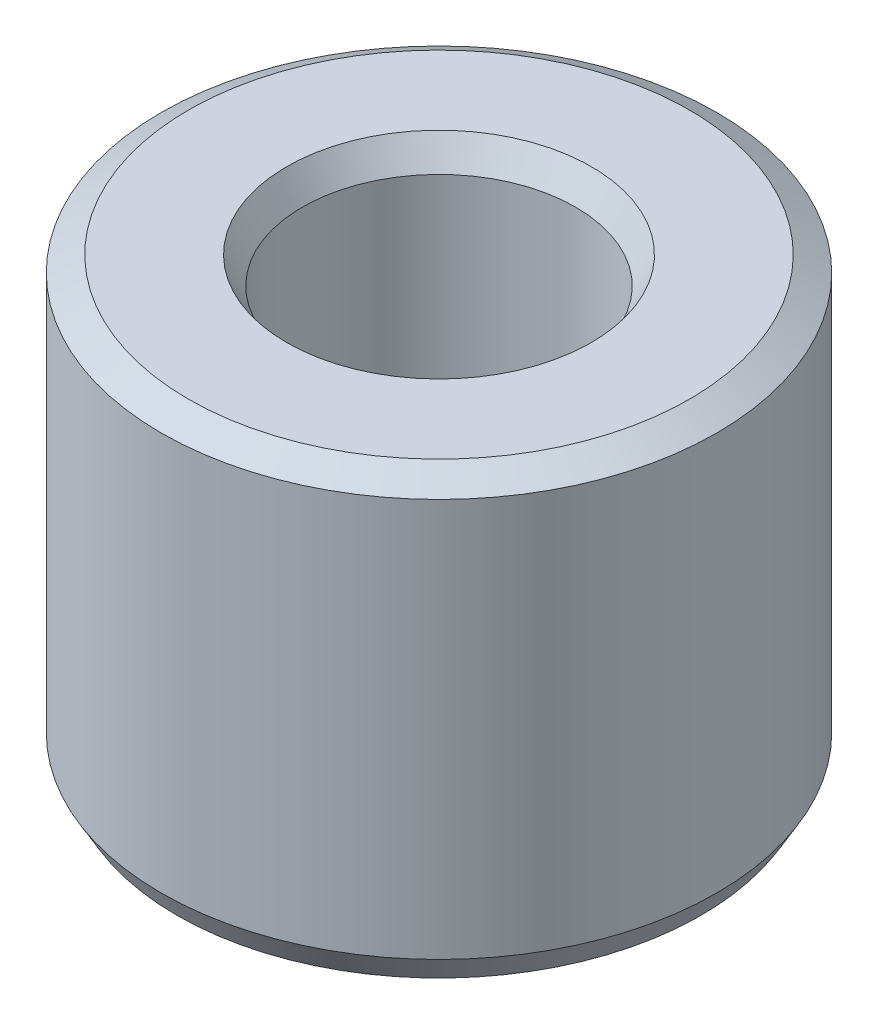
ISO-10303-21;
HEADER;
FILE_DESCRIPTION(('STEP AP214'),'2;1');
FILE_NAME('part.step','',(''),(''),'','','');
FILE_SCHEMA(('AUTOMOTIVE_DESIGN { 1 0 10303 214 1 1 1 1 }'));
ENDSEC;
DATA;
#1=APPLICATION_CONTEXT('core data for automotive mechanical design processes');
#2=APPLICATION_PROTOCOL_DEFINITION('international standard','automotive_design',2000,#1);
#3=PRODUCT_CONTEXT('',#1,'mechanical');
#4=PRODUCT('Part','Part','',(#3));
#5=PRODUCT_RELATED_PRODUCT_CATEGORY('part','',(#4));
#6=PRODUCT_DEFINITION_FORMATION('','',#4);
#7=PRODUCT_DEFINITION_CONTEXT('part definition',#1,'design');
#8=PRODUCT_DEFINITION('design','',#6,#7);
#9=PRODUCT_DEFINITION_SHAPE('','',#8);
#10=(LENGTH_UNIT() NAMED_UNIT(*) SI_UNIT(.MILLI.,.METRE.));
#11=(NAMED_UNIT(*) PLANE_ANGLE_UNIT() SI_UNIT($,.RADIAN.));
#12=(NAMED_UNIT(*) SI_UNIT($,.STERADIAN.) SOLID_ANGLE_UNIT());
#13=UNCERTAINTY_MEASURE_WITH_UNIT(LENGTH_MEASURE(1.E-05),#10,'distance_accuracy_value','');
#14=(GEOMETRIC_REPRESENTATION_CONTEXT(3) GLOBAL_UNCERTAINTY_ASSIGNED_CONTEXT((#13)) GLOBAL_UNIT_ASSIGNED_CONTEXT((#10,
#11,#12)) REPRESENTATION_CONTEXT('',''));
#15=CARTESIAN_POINT('',(0.,0.,0.));
#16=DIRECTION('',(0.,0.,1.));
#17=DIRECTION('',(1.,0.,0.));
#18=AXIS2_PLACEMENT_3D('',#15,#16,#17);
#19=CARTESIAN_POINT('',(0.,55.6202422081546,0.));
#20=DIRECTION('',(0.,-1.,0.));
#21=DIRECTION('',(0.,0.,-1.));
#22=AXIS2_PLACEMENT_3D('',#19,#20,#21);
#23=CYLINDRICAL_SURFACE('',#22,35.);
#24=CARTESIAN_POINT('',(0.,3.42848000510424,0.));
#25=DIRECTION('',(0.,1.,0.));
#26=DIRECTION('',(0.,0.,1.));
#27=AXIS2_PLACEMENT_3D('',#24,#25,#26);
#28=CIRCLE('',#27,35.);
#29=CARTESIAN_POINT('',(0.,3.42848000510424,35.));
#30=VERTEX_POINT('',#29);
#31=EDGE_CURVE('E10',#30,#30,#28,.T.);
#32=ORIENTED_EDGE('',*,*,#31,.T.);
#33=EDGE_LOOP('',(#32));
#34=FACE_BOUND('',#33,.T.);
#35=CARTESIAN_POINT('',(0.,53.6408083542964,0.));
#36=DIRECTION('',(0.,1.,0.));
#37=DIRECTION('',(0.,0.,1.));
#38=AXIS2_PLACEMENT_3D('',#35,#36,#37);
#39=CIRCLE('',#38,35.);
#40=CARTESIAN_POINT('',(0.,53.6408083542964,35.));
#41=VERTEX_POINT('',#40);
#42=EDGE_CURVE('E50',#41,#41,#39,.F.);
#43=ORIENTED_EDGE('',*,*,#42,.T.);
#44=EDGE_LOOP('',(#43));
#45=FACE_BOUND('',#44,.T.);
#46=ADVANCED_FACE('F39',(#34,#45),#23,.T.);
#47=CARTESIAN_POINT('',(0.,55.6202422081546,0.));
#48=DIRECTION('',(0.,1.,0.));
#49=DIRECTION('',(0.,0.,1.));
#50=AXIS2_PLACEMENT_3D('',#47,#48,#49);
#51=PLANE('',#50);
#52=CARTESIAN_POINT('',(0.,55.6202422081546,0.));
#53=DIRECTION('',(0.,1.,0.));
#54=DIRECTION('',(0.,0.,1.));
#55=AXIS2_PLACEMENT_3D('',#52,#53,#54);
#56=CIRCLE('',#55,19.2047234052171);
#57=CARTESIAN_POINT('',(0.,55.6202422081546,19.2047234052171));
#58=VERTEX_POINT('',#57);
#59=EDGE_CURVE('E58',#58,#58,#56,.F.);
#60=ORIENTED_EDGE('',*,*,#59,.T.);
#61=EDGE_LOOP('',(#60));
#62=FACE_BOUND('',#61,.T.);
#63=CARTESIAN_POINT('',(0.,55.6202422081546,0.));
#64=DIRECTION('',(0.,1.,0.));
#65=DIRECTION('',(0.,0.,1.));
#66=AXIS2_PLACEMENT_3D('',#63,#64,#65);
#67=CIRCLE('',#66,31.5715199948958);
#68=CARTESIAN_POINT('',(0.,55.6202422081546,31.5715199948958));
#69=VERTEX_POINT('',#68);
#70=EDGE_CURVE('E61',#69,#69,#67,.T.);
#71=ORIENTED_EDGE('',*,*,#70,.T.);
#72=EDGE_LOOP('',(#71));
#73=FACE_BOUND('',#72,.T.);
#74=ADVANCED_FACE('F88',(#62,#73),#51,.T.);
#75=CARTESIAN_POINT('',(0.,0.,0.));
#76=DIRECTION('',(0.,1.,0.));
#77=DIRECTION('',(0.,0.,1.));
#78=AXIS2_PLACEMENT_3D('',#75,#76,#77);
#79=PLANE('',#78);
#80=CARTESIAN_POINT('',(0.,0.,0.));
#81=DIRECTION('',(0.,1.,0.));
#82=DIRECTION('',(0.,0.,1.));
#83=AXIS2_PLACEMENT_3D('',#80,#81,#82);
#84=CIRCLE('',#83,20.6537695564631);
#85=CARTESIAN_POINT('',(0.,0.,20.6537695564631));
#86=VERTEX_POINT('',#85);
#87=EDGE_CURVE('E51',#86,#86,#84,.T.);
#88=ORIENTED_EDGE('',*,*,#87,.T.);
#89=EDGE_LOOP('',(#88));
#90=FACE_BOUND('',#89,.T.);
#91=CARTESIAN_POINT('',(0.,0.,0.));
#92=DIRECTION('',(0.,1.,0.));
#93=DIRECTION('',(0.,0.,1.));
#94=AXIS2_PLACEMENT_3D('',#91,#92,#93);
#95=CIRCLE('',#94,33.0205661461418);
#96=CARTESIAN_POINT('',(0.,0.,33.0205661461418));
#97=VERTEX_POINT('',#96);
#98=EDGE_CURVE('E54',#97,#97,#95,.F.);
#99=ORIENTED_EDGE('',*,*,#98,.T.);
#100=EDGE_LOOP('',(#99));
#101=FACE_BOUND('',#100,.T.);
#102=ADVANCED_FACE('F83',(#90,#101),#79,.F.);
#103=CARTESIAN_POINT('',(0.,55.6202422081546,0.));
#104=DIRECTION('',(0.,-1.,0.));
#105=DIRECTION('',(0.,0.,-1.));
#106=AXIS2_PLACEMENT_3D('',#103,#104,#105);
#107=CYLINDRICAL_SURFACE('',#106,17.2252895513589);
#108=CARTESIAN_POINT('',(0.,52.1917622030504,0.));
#109=DIRECTION('',(0.,1.,0.));
#110=DIRECTION('',(0.,0.,1.));
#111=AXIS2_PLACEMENT_3D('',#108,#109,#110);
#112=CIRCLE('',#111,17.2252895513589);
#113=CARTESIAN_POINT('',(0.,52.1917622030504,17.2252895513589));
#114=VERTEX_POINT('',#113);
#115=EDGE_CURVE('E67',#114,#114,#112,.T.);
#116=ORIENTED_EDGE('',*,*,#115,.T.);
#117=EDGE_LOOP('',(#116));
#118=FACE_BOUND('',#117,.T.);
#119=CARTESIAN_POINT('',(0.,1.97943385385817,0.));
#120=DIRECTION('',(0.,1.,0.));
#121=DIRECTION('',(0.,0.,1.));
#122=AXIS2_PLACEMENT_3D('',#119,#120,#121);
#123=CIRCLE('',#122,17.2252895513589);
#124=CARTESIAN_POINT('',(0.,1.97943385385817,17.2252895513589));
#125=VERTEX_POINT('',#124);
#126=EDGE_CURVE('E69',#125,#125,#123,.F.);
#127=ORIENTED_EDGE('',*,*,#126,.T.);
#128=EDGE_LOOP('',(#127));
#129=FACE_BOUND('',#128,.T.);
#130=ADVANCED_FACE('F71',(#118,#129),#107,.F.);
#131=CARTESIAN_POINT('',(0.,52.1917622030504,0.));
#132=DIRECTION('',(0.,1.,0.));
#133=DIRECTION('',(0.,0.,1.));
#134=AXIS2_PLACEMENT_3D('',#131,#132,#133);
#135=CONICAL_SURFACE('',#134,17.2252895513589,0.523598775598301);
#136=ORIENTED_EDGE('',*,*,#59,.F.);
#137=EDGE_LOOP('',(#136));
#138=FACE_BOUND('',#137,.T.);
#139=ORIENTED_EDGE('',*,*,#115,.F.);
#140=EDGE_LOOP('',(#139));
#141=FACE_BOUND('',#140,.T.);
#142=ADVANCED_FACE('F77',(#138,#141),#135,.F.);
#143=CARTESIAN_POINT('',(0.,0.,0.));
#144=DIRECTION('',(0.,-1.,0.));
#145=DIRECTION('',(0.,0.,-1.));
#146=AXIS2_PLACEMENT_3D('',#143,#144,#145);
#147=CONICAL_SURFACE('',#146,20.6537695564631,1.04719755119659);
#148=ORIENTED_EDGE('',*,*,#126,.F.);
#149=EDGE_LOOP('',(#148));
#150=FACE_BOUND('',#149,.T.);
#151=ORIENTED_EDGE('',*,*,#87,.F.);
#152=EDGE_LOOP('',(#151));
#153=FACE_BOUND('',#152,.T.);
#154=ADVANCED_FACE('F73',(#150,#153),#147,.F.);
#155=CARTESIAN_POINT('',(0.,3.42848000510424,0.));
#156=DIRECTION('',(0.,1.,0.));
#157=DIRECTION('',(0.,0.,1.));
#158=AXIS2_PLACEMENT_3D('',#155,#156,#157);
#159=CONICAL_SURFACE('',#158,35.,0.523598775598301);
#160=ORIENTED_EDGE('',*,*,#98,.F.);
#161=EDGE_LOOP('',(#160));
#162=FACE_BOUND('',#161,.T.);
#163=ORIENTED_EDGE('',*,*,#31,.F.);
#164=EDGE_LOOP('',(#163));
#165=FACE_BOUND('',#164,.T.);
#166=ADVANCED_FACE('F76',(#162,#165),#159,.T.);
#167=CARTESIAN_POINT('',(0.,55.6202422081546,0.));
#168=DIRECTION('',(0.,-1.,0.));
#169=DIRECTION('',(0.,0.,-1.));
#170=AXIS2_PLACEMENT_3D('',#167,#168,#169);
#171=CONICAL_SURFACE('',#170,31.5715199948958,1.04719755119659);
#172=ORIENTED_EDGE('',*,*,#42,.F.);
#173=EDGE_LOOP('',(#172));
#174=FACE_BOUND('',#173,.T.);
#175=ORIENTED_EDGE('',*,*,#70,.F.);
#176=EDGE_LOOP('',(#175));
#177=FACE_BOUND('',#176,.T.);
#178=ADVANCED_FACE('F45',(#174,#177),#171,.T.);
#179=CLOSED_SHELL('',(#46,#74,#102,#130,#142,#154,#166,#178));
#180=MANIFOLD_SOLID_BREP('B2',#179);
#181=ADVANCED_BREP_SHAPE_REPRESENTATION('',(#18,#180),#14);
#182=SHAPE_DEFINITION_REPRESENTATION(#9,#181);
ENDSEC;
END-ISO-10303-21;
